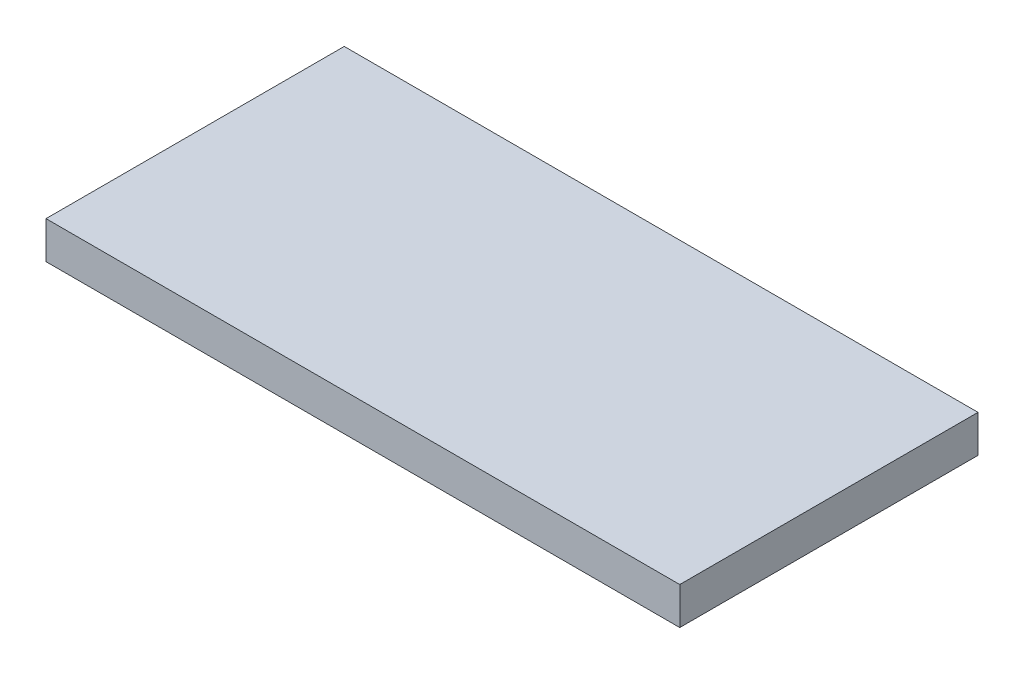
ISO-10303-21;
HEADER;
FILE_DESCRIPTION(('STEP AP214'),'2;1');
FILE_NAME('part.step','',(''),(''),'','','');
FILE_SCHEMA(('AUTOMOTIVE_DESIGN { 1 0 10303 214 1 1 1 1 }'));
ENDSEC;
DATA;
#1=APPLICATION_CONTEXT('core data for automotive mechanical design processes');
#2=APPLICATION_PROTOCOL_DEFINITION('international standard','automotive_design',2000,#1);
#3=PRODUCT_CONTEXT('',#1,'mechanical');
#4=PRODUCT('Part','Part','',(#3));
#5=PRODUCT_RELATED_PRODUCT_CATEGORY('part','',(#4));
#6=PRODUCT_DEFINITION_FORMATION('','',#4);
#7=PRODUCT_DEFINITION_CONTEXT('part definition',#1,'design');
#8=PRODUCT_DEFINITION('design','',#6,#7);
#9=PRODUCT_DEFINITION_SHAPE('','',#8);
#10=(LENGTH_UNIT() NAMED_UNIT(*) SI_UNIT(.MILLI.,.METRE.));
#11=(NAMED_UNIT(*) PLANE_ANGLE_UNIT() SI_UNIT($,.RADIAN.));
#12=(NAMED_UNIT(*) SI_UNIT($,.STERADIAN.) SOLID_ANGLE_UNIT());
#13=UNCERTAINTY_MEASURE_WITH_UNIT(LENGTH_MEASURE(1.E-05),#10,'distance_accuracy_value','');
#14=(GEOMETRIC_REPRESENTATION_CONTEXT(3) GLOBAL_UNCERTAINTY_ASSIGNED_CONTEXT((#13)) GLOBAL_UNIT_ASSIGNED_CONTEXT((#10,
#11,#12)) REPRESENTATION_CONTEXT('',''));
#15=CARTESIAN_POINT('',(0.,0.,0.));
#16=DIRECTION('',(0.,0.,1.));
#17=DIRECTION('',(1.,0.,0.));
#18=AXIS2_PLACEMENT_3D('',#15,#16,#17);
#19=CARTESIAN_POINT('',(-40.8625954198473,5.,-12.4885496183206));
#20=DIRECTION('',(1.,0.,0.));
#21=DIRECTION('',(0.,0.,-1.));
#22=AXIS2_PLACEMENT_3D('',#19,#20,#21);
#23=PLANE('',#22);
#24=DIRECTION('',(0.,0.,1.));
#25=VECTOR('',#24,1.);
#26=CARTESIAN_POINT('',(-40.8625954198473,0.,-12.4885496183206));
#27=LINE('',#26,#25);
#28=CARTESIAN_POINT('',(-40.8625954198473,0.,-12.4885496183206));
#29=VERTEX_POINT('',#28);
#30=CARTESIAN_POINT('',(-40.8625954198473,0.,27.5114503816794));
#31=VERTEX_POINT('',#30);
#32=EDGE_CURVE('E96',#29,#31,#27,.T.);
#33=ORIENTED_EDGE('',*,*,#32,.T.);
#34=DIRECTION('',(0.,-1.,0.));
#35=VECTOR('',#34,1.);
#36=CARTESIAN_POINT('',(-40.8625954198473,5.,27.5114503816794));
#37=LINE('',#36,#35);
#38=CARTESIAN_POINT('',(-40.8625954198473,5.,27.5114503816794));
#39=VERTEX_POINT('',#38);
#40=EDGE_CURVE('E11',#39,#31,#37,.T.);
#41=ORIENTED_EDGE('',*,*,#40,.F.);
#42=DIRECTION('',(0.,0.,1.));
#43=VECTOR('',#42,1.);
#44=CARTESIAN_POINT('',(-40.8625954198473,5.,-12.4885496183206));
#45=LINE('',#44,#43);
#46=CARTESIAN_POINT('',(-40.8625954198473,5.,-12.4885496183206));
#47=VERTEX_POINT('',#46);
#48=EDGE_CURVE('E84',#47,#39,#45,.T.);
#49=ORIENTED_EDGE('',*,*,#48,.F.);
#50=DIRECTION('',(0.,-1.,0.));
#51=VECTOR('',#50,1.);
#52=CARTESIAN_POINT('',(-40.8625954198473,5.,-12.4885496183206));
#53=LINE('',#52,#51);
#54=EDGE_CURVE('E92',#47,#29,#53,.T.);
#55=ORIENTED_EDGE('',*,*,#54,.T.);
#56=EDGE_LOOP('',(#33,#41,#49,#55));
#57=FACE_BOUND('',#56,.T.);
#58=ADVANCED_FACE('F33',(#57),#23,.F.);
#59=CARTESIAN_POINT('',(-40.8625954198473,5.,27.5114503816794));
#60=DIRECTION('',(0.,0.,-1.));
#61=DIRECTION('',(-1.,0.,0.));
#62=AXIS2_PLACEMENT_3D('',#59,#60,#61);
#63=PLANE('',#62);
#64=DIRECTION('',(1.,0.,0.));
#65=VECTOR('',#64,1.);
#66=CARTESIAN_POINT('',(-40.8625954198473,0.,27.5114503816794));
#67=LINE('',#66,#65);
#68=CARTESIAN_POINT('',(44.1374045801527,0.,27.5114503816794));
#69=VERTEX_POINT('',#68);
#70=EDGE_CURVE('E88',#31,#69,#67,.T.);
#71=ORIENTED_EDGE('',*,*,#70,.T.);
#72=DIRECTION('',(0.,-1.,0.));
#73=VECTOR('',#72,1.);
#74=CARTESIAN_POINT('',(44.1374045801527,5.,27.5114503816794));
#75=LINE('',#74,#73);
#76=CARTESIAN_POINT('',(44.1374045801527,5.,27.5114503816794));
#77=VERTEX_POINT('',#76);
#78=EDGE_CURVE('E41',#77,#69,#75,.T.);
#79=ORIENTED_EDGE('',*,*,#78,.F.);
#80=DIRECTION('',(1.,0.,0.));
#81=VECTOR('',#80,1.);
#82=CARTESIAN_POINT('',(-40.8625954198473,5.,27.5114503816794));
#83=LINE('',#82,#81);
#84=EDGE_CURVE('E79',#39,#77,#83,.T.);
#85=ORIENTED_EDGE('',*,*,#84,.F.);
#86=ORIENTED_EDGE('',*,*,#40,.T.);
#87=EDGE_LOOP('',(#71,#79,#85,#86));
#88=FACE_BOUND('',#87,.T.);
#89=ADVANCED_FACE('F87',(#88),#63,.F.);
#90=CARTESIAN_POINT('',(44.1374045801527,5.,-12.4885496183206));
#91=DIRECTION('',(-1.,0.,0.));
#92=DIRECTION('',(0.,0.,1.));
#93=AXIS2_PLACEMENT_3D('',#90,#91,#92);
#94=PLANE('',#93);
#95=DIRECTION('',(0.,0.,-1.));
#96=VECTOR('',#95,1.);
#97=CARTESIAN_POINT('',(44.1374045801527,0.,-12.4885496183206));
#98=LINE('',#97,#96);
#99=CARTESIAN_POINT('',(44.1374045801527,0.,-12.4885496183206));
#100=VERTEX_POINT('',#99);
#101=EDGE_CURVE('E66',#69,#100,#98,.T.);
#102=ORIENTED_EDGE('',*,*,#101,.T.);
#103=DIRECTION('',(0.,-1.,0.));
#104=VECTOR('',#103,1.);
#105=CARTESIAN_POINT('',(44.1374045801527,5.,-12.4885496183206));
#106=LINE('',#105,#104);
#107=CARTESIAN_POINT('',(44.1374045801527,5.,-12.4885496183206));
#108=VERTEX_POINT('',#107);
#109=EDGE_CURVE('E89',#108,#100,#106,.T.);
#110=ORIENTED_EDGE('',*,*,#109,.F.);
#111=DIRECTION('',(0.,0.,-1.));
#112=VECTOR('',#111,1.);
#113=CARTESIAN_POINT('',(44.1374045801527,5.,-12.4885496183206));
#114=LINE('',#113,#112);
#115=EDGE_CURVE('E82',#77,#108,#114,.T.);
#116=ORIENTED_EDGE('',*,*,#115,.F.);
#117=ORIENTED_EDGE('',*,*,#78,.T.);
#118=EDGE_LOOP('',(#102,#110,#116,#117));
#119=FACE_BOUND('',#118,.T.);
#120=ADVANCED_FACE('F90',(#119),#94,.F.);
#121=CARTESIAN_POINT('',(-40.8625954198473,5.,-12.4885496183206));
#122=DIRECTION('',(0.,0.,1.));
#123=DIRECTION('',(1.,0.,0.));
#124=AXIS2_PLACEMENT_3D('',#121,#122,#123);
#125=PLANE('',#124);
#126=DIRECTION('',(-1.,0.,0.));
#127=VECTOR('',#126,1.);
#128=CARTESIAN_POINT('',(-40.8625954198473,0.,-12.4885496183206));
#129=LINE('',#128,#127);
#130=EDGE_CURVE('E72',#100,#29,#129,.T.);
#131=ORIENTED_EDGE('',*,*,#130,.T.);
#132=ORIENTED_EDGE('',*,*,#54,.F.);
#133=DIRECTION('',(-1.,0.,0.));
#134=VECTOR('',#133,1.);
#135=CARTESIAN_POINT('',(-40.8625954198473,5.,-12.4885496183206));
#136=LINE('',#135,#134);
#137=EDGE_CURVE('E49',#108,#47,#136,.T.);
#138=ORIENTED_EDGE('',*,*,#137,.F.);
#139=ORIENTED_EDGE('',*,*,#109,.T.);
#140=EDGE_LOOP('',(#131,#132,#138,#139));
#141=FACE_BOUND('',#140,.T.);
#142=ADVANCED_FACE('F103',(#141),#125,.F.);
#143=CARTESIAN_POINT('',(0.,5.,0.));
#144=DIRECTION('',(0.,1.,0.));
#145=DIRECTION('',(0.,0.,1.));
#146=AXIS2_PLACEMENT_3D('',#143,#144,#145);
#147=PLANE('',#146);
#148=ORIENTED_EDGE('',*,*,#48,.T.);
#149=ORIENTED_EDGE('',*,*,#84,.T.);
#150=ORIENTED_EDGE('',*,*,#115,.T.);
#151=ORIENTED_EDGE('',*,*,#137,.T.);
#152=EDGE_LOOP('',(#148,#149,#150,#151));
#153=FACE_BOUND('',#152,.T.);
#154=ADVANCED_FACE('F80',(#153),#147,.T.);
#155=CARTESIAN_POINT('',(0.,0.,0.));
#156=DIRECTION('',(0.,1.,0.));
#157=DIRECTION('',(0.,0.,1.));
#158=AXIS2_PLACEMENT_3D('',#155,#156,#157);
#159=PLANE('',#158);
#160=ORIENTED_EDGE('',*,*,#32,.F.);
#161=ORIENTED_EDGE('',*,*,#130,.F.);
#162=ORIENTED_EDGE('',*,*,#101,.F.);
#163=ORIENTED_EDGE('',*,*,#70,.F.);
#164=EDGE_LOOP('',(#160,#161,#162,#163));
#165=FACE_BOUND('',#164,.T.);
#166=ADVANCED_FACE('F106',(#165),#159,.F.);
#167=CLOSED_SHELL('',(#58,#89,#120,#142,#154,#166));
#168=MANIFOLD_SOLID_BREP('B2',#167);
#169=ADVANCED_BREP_SHAPE_REPRESENTATION('',(#18,#168),#14);
#170=SHAPE_DEFINITION_REPRESENTATION(#9,#169);
ENDSEC;
END-ISO-10303-21;
